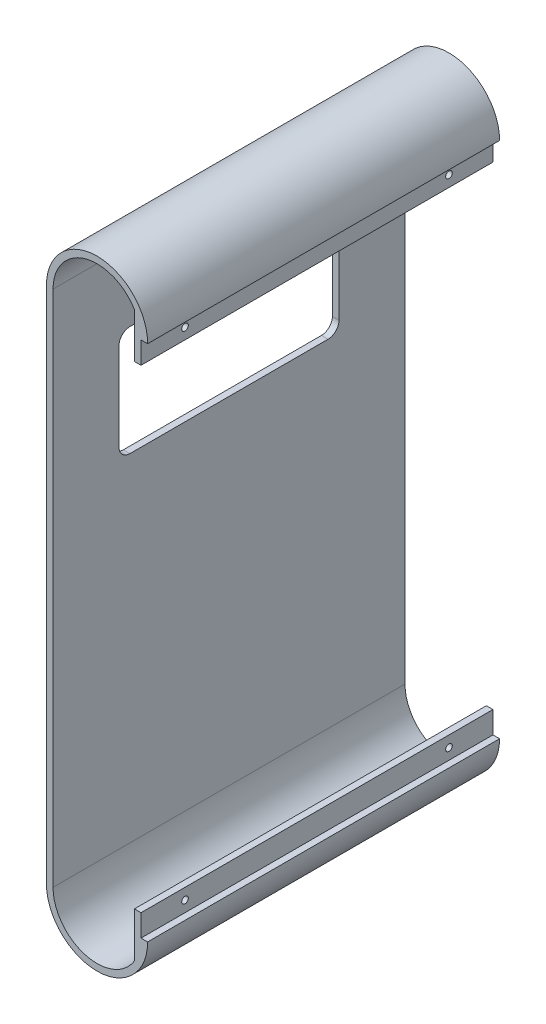
ISO-10303-21;
HEADER;
FILE_DESCRIPTION(('STEP AP214'),'2;1');
FILE_NAME('part.step','',(''),(''),'','','');
FILE_SCHEMA(('AUTOMOTIVE_DESIGN { 1 0 10303 214 1 1 1 1 }'));
ENDSEC;
DATA;
#1=APPLICATION_CONTEXT('core data for automotive mechanical design processes');
#2=APPLICATION_PROTOCOL_DEFINITION('international standard','automotive_design',2000,#1);
#3=PRODUCT_CONTEXT('',#1,'mechanical');
#4=PRODUCT('Part','Part','',(#3));
#5=PRODUCT_RELATED_PRODUCT_CATEGORY('part','',(#4));
#6=PRODUCT_DEFINITION_FORMATION('','',#4);
#7=PRODUCT_DEFINITION_CONTEXT('part definition',#1,'design');
#8=PRODUCT_DEFINITION('design','',#6,#7);
#9=PRODUCT_DEFINITION_SHAPE('','',#8);
#10=(LENGTH_UNIT() NAMED_UNIT(*) SI_UNIT(.MILLI.,.METRE.));
#11=(NAMED_UNIT(*) PLANE_ANGLE_UNIT() SI_UNIT($,.RADIAN.));
#12=(NAMED_UNIT(*) SI_UNIT($,.STERADIAN.) SOLID_ANGLE_UNIT());
#13=UNCERTAINTY_MEASURE_WITH_UNIT(LENGTH_MEASURE(1.E-05),#10,'distance_accuracy_value','');
#14=(GEOMETRIC_REPRESENTATION_CONTEXT(3) GLOBAL_UNCERTAINTY_ASSIGNED_CONTEXT((#13)) GLOBAL_UNIT_ASSIGNED_CONTEXT((#10,
#11,#12)) REPRESENTATION_CONTEXT('',''));
#15=CARTESIAN_POINT('',(0.,0.,0.));
#16=DIRECTION('',(0.,0.,1.));
#17=DIRECTION('',(1.,0.,0.));
#18=AXIS2_PLACEMENT_3D('',#15,#16,#17);
#19=CARTESIAN_POINT('',(4.,60.2499999999995,-160.000000000005));
#20=DIRECTION('',(0.,0.,-1.));
#21=DIRECTION('',(0.,-1.,0.));
#22=AXIS2_PLACEMENT_3D('',#19,#20,#21);
#23=PLANE('',#22);
#24=DIRECTION('',(1.,0.,0.));
#25=VECTOR('',#24,1.);
#26=CARTESIAN_POINT('',(0.,160.5,-160.000000000007));
#27=LINE('',#26,#25);
#28=CARTESIAN_POINT('',(0.,160.5,-160.000000000007));
#29=VERTEX_POINT('',#28);
#30=CARTESIAN_POINT('',(3.,160.5,-160.000000000007));
#31=VERTEX_POINT('',#30);
#32=EDGE_CURVE('E345',#29,#31,#27,.T.);
#33=ORIENTED_EDGE('',*,*,#32,.F.);
#34=DIRECTION('',(0.,-1.,0.));
#35=VECTOR('',#34,1.);
#36=CARTESIAN_POINT('',(-1.91556839834739E-12,150.500000000001,-160.000000000007));
#37=LINE('',#36,#35);
#38=CARTESIAN_POINT('',(-1.91556839834739E-12,150.500000000001,-160.000000000007));
#39=VERTEX_POINT('',#38);
#40=EDGE_CURVE('E262',#29,#39,#37,.T.);
#41=ORIENTED_EDGE('',*,*,#40,.T.);
#42=DIRECTION('',(-1.,0.,0.));
#43=VECTOR('',#42,1.);
#44=CARTESIAN_POINT('',(-3.00000000000191,150.500000000001,-160.000000000007));
#45=LINE('',#44,#43);
#46=CARTESIAN_POINT('',(-3.00000000000191,150.500000000001,-160.000000000007));
#47=VERTEX_POINT('',#46);
#48=EDGE_CURVE('E261',#39,#47,#45,.T.);
#49=ORIENTED_EDGE('',*,*,#48,.T.);
#50=DIRECTION('',(0.,1.,0.));
#51=VECTOR('',#50,1.);
#52=CARTESIAN_POINT('',(-3.00000000000191,150.500000000001,-160.000000000007));
#53=LINE('',#52,#51);
#54=CARTESIAN_POINT('',(-3.00000000000229,171.035653752857,-160.000000000007));
#55=VERTEX_POINT('',#54);
#56=EDGE_CURVE('E265',#47,#55,#53,.T.);
#57=ORIENTED_EDGE('',*,*,#56,.T.);
#58=CARTESIAN_POINT('',(-20.,160.5,-160.000000000007));
#59=DIRECTION('',(0.,0.,-1.));
#60=DIRECTION('',(0.,1.,0.));
#61=AXIS2_PLACEMENT_3D('',#58,#59,#60);
#62=CIRCLE('',#61,20.);
#63=CARTESIAN_POINT('',(-40.,160.5,-160.000000000005));
#64=VERTEX_POINT('',#63);
#65=EDGE_CURVE('E349',#64,#55,#62,.T.);
#66=ORIENTED_EDGE('',*,*,#65,.F.);
#67=DIRECTION('',(0.,1.,0.));
#68=VECTOR('',#67,1.);
#69=CARTESIAN_POINT('',(-40.,-74.9999999999967,-160.000000000004));
#70=LINE('',#69,#68);
#71=CARTESIAN_POINT('',(-40.,-75.,-160.000000000004));
#72=VERTEX_POINT('',#71);
#73=EDGE_CURVE('E307',#72,#64,#70,.T.);
#74=ORIENTED_EDGE('',*,*,#73,.F.);
#75=CARTESIAN_POINT('',(-20.,-75.,-160.000000000004));
#76=DIRECTION('',(0.,0.,-1.));
#77=DIRECTION('',(0.,1.,0.));
#78=AXIS2_PLACEMENT_3D('',#75,#76,#77);
#79=CIRCLE('',#78,20.);
#80=CARTESIAN_POINT('',(-3.,-85.5356537528528,-160.000000000004));
#81=VERTEX_POINT('',#80);
#82=EDGE_CURVE('E328',#81,#72,#79,.T.);
#83=ORIENTED_EDGE('',*,*,#82,.F.);
#84=DIRECTION('',(0.,1.,0.));
#85=VECTOR('',#84,1.);
#86=CARTESIAN_POINT('',(-3.,-65.,-160.000000000004));
#87=LINE('',#86,#85);
#88=CARTESIAN_POINT('',(-3.,-65.,-160.000000000004));
#89=VERTEX_POINT('',#88);
#90=EDGE_CURVE('E282',#81,#89,#87,.T.);
#91=ORIENTED_EDGE('',*,*,#90,.T.);
#92=DIRECTION('',(1.,0.,0.));
#93=VECTOR('',#92,1.);
#94=CARTESIAN_POINT('',(-3.,-65.,-160.000000000004));
#95=LINE('',#94,#93);
#96=CARTESIAN_POINT('',(0.,-65.,-160.000000000004));
#97=VERTEX_POINT('',#96);
#98=EDGE_CURVE('E287',#89,#97,#95,.T.);
#99=ORIENTED_EDGE('',*,*,#98,.T.);
#100=DIRECTION('',(0.,-1.,0.));
#101=VECTOR('',#100,1.);
#102=CARTESIAN_POINT('',(0.,-65.,-160.000000000004));
#103=LINE('',#102,#101);
#104=CARTESIAN_POINT('',(0.,-75.,-160.000000000004));
#105=VERTEX_POINT('',#104);
#106=EDGE_CURVE('E283',#97,#105,#103,.T.);
#107=ORIENTED_EDGE('',*,*,#106,.T.);
#108=DIRECTION('',(-1.,0.,0.));
#109=VECTOR('',#108,1.);
#110=CARTESIAN_POINT('',(0.,-75.,-160.000000000004));
#111=LINE('',#110,#109);
#112=CARTESIAN_POINT('',(3.,-75.,-160.000000000004));
#113=VERTEX_POINT('',#112);
#114=EDGE_CURVE('E332',#113,#105,#111,.T.);
#115=ORIENTED_EDGE('',*,*,#114,.F.);
#116=CARTESIAN_POINT('',(-20.,-75.,-160.000000000004));
#117=DIRECTION('',(0.,0.,-1.));
#118=DIRECTION('',(0.,1.,0.));
#119=AXIS2_PLACEMENT_3D('',#116,#117,#118);
#120=CIRCLE('',#119,23.);
#121=CARTESIAN_POINT('',(-43.,-75.,-160.000000000004));
#122=VERTEX_POINT('',#121);
#123=EDGE_CURVE('E335',#122,#113,#120,.F.);
#124=ORIENTED_EDGE('',*,*,#123,.F.);
#125=DIRECTION('',(0.,-1.,0.));
#126=VECTOR('',#125,1.);
#127=CARTESIAN_POINT('',(-43.,-74.9999999999967,-160.000000000004));
#128=LINE('',#127,#126);
#129=CARTESIAN_POINT('',(-43.,160.5,-160.000000000007));
#130=VERTEX_POINT('',#129);
#131=EDGE_CURVE('E338',#130,#122,#128,.T.);
#132=ORIENTED_EDGE('',*,*,#131,.F.);
#133=CARTESIAN_POINT('',(-20.,160.5,-160.000000000007));
#134=DIRECTION('',(0.,0.,-1.));
#135=DIRECTION('',(0.,1.,0.));
#136=AXIS2_PLACEMENT_3D('',#133,#134,#135);
#137=CIRCLE('',#136,23.);
#138=EDGE_CURVE('E342',#31,#130,#137,.F.);
#139=ORIENTED_EDGE('',*,*,#138,.F.);
#140=EDGE_LOOP('',(#33,#41,#49,#57,#66,#74,#83,#91,#99,#107,#115,#124,#132,#139));
#141=FACE_BOUND('',#140,.T.);
#142=ADVANCED_FACE('F35',(#141),#23,.T.);
#143=CARTESIAN_POINT('',(-20.,-75.,0.));
#144=DIRECTION('',(0.,0.,1.));
#145=DIRECTION('',(1.,0.,0.));
#146=AXIS2_PLACEMENT_3D('',#143,#144,#145);
#147=PLANE('',#146);
#148=CARTESIAN_POINT('',(-20.,160.5,0.));
#149=DIRECTION('',(0.,0.,-1.));
#150=DIRECTION('',(-1.,0.,0.));
#151=AXIS2_PLACEMENT_3D('',#148,#149,#150);
#152=CIRCLE('',#151,20.);
#153=CARTESIAN_POINT('',(-40.,160.5,0.));
#154=VERTEX_POINT('',#153);
#155=CARTESIAN_POINT('',(-3.00000000000229,171.035653752857,0.));
#156=VERTEX_POINT('',#155);
#157=EDGE_CURVE('E318',#154,#156,#152,.T.);
#158=ORIENTED_EDGE('',*,*,#157,.T.);
#159=DIRECTION('',(0.,1.,0.));
#160=VECTOR('',#159,1.);
#161=CARTESIAN_POINT('',(-3.00000000000191,150.500000000003,0.));
#162=LINE('',#161,#160);
#163=CARTESIAN_POINT('',(-3.00000000000191,150.500000000001,0.));
#164=VERTEX_POINT('',#163);
#165=EDGE_CURVE('E264',#164,#156,#162,.T.);
#166=ORIENTED_EDGE('',*,*,#165,.F.);
#167=DIRECTION('',(-1.,0.,0.));
#168=VECTOR('',#167,1.);
#169=CARTESIAN_POINT('',(-3.00000000000191,150.500000000003,0.));
#170=LINE('',#169,#168);
#171=CARTESIAN_POINT('',(-1.91556839834736E-12,150.500000000001,0.));
#172=VERTEX_POINT('',#171);
#173=EDGE_CURVE('E273',#172,#164,#170,.T.);
#174=ORIENTED_EDGE('',*,*,#173,.F.);
#175=DIRECTION('',(0.,-1.,0.));
#176=VECTOR('',#175,1.);
#177=CARTESIAN_POINT('',(-1.91556839834739E-12,150.500000000003,0.));
#178=LINE('',#177,#176);
#179=CARTESIAN_POINT('',(-2.09730250691962E-12,160.5,0.));
#180=VERTEX_POINT('',#179);
#181=EDGE_CURVE('E272',#180,#172,#178,.T.);
#182=ORIENTED_EDGE('',*,*,#181,.F.);
#183=DIRECTION('',(1.,0.,0.));
#184=VECTOR('',#183,1.);
#185=CARTESIAN_POINT('',(0.,160.5,0.));
#186=LINE('',#185,#184);
#187=CARTESIAN_POINT('',(3.,160.5,0.));
#188=VERTEX_POINT('',#187);
#189=EDGE_CURVE('E315',#180,#188,#186,.T.);
#190=ORIENTED_EDGE('',*,*,#189,.T.);
#191=CARTESIAN_POINT('',(-20.,160.5,0.));
#192=DIRECTION('',(0.,0.,1.));
#193=DIRECTION('',(-1.,0.,0.));
#194=AXIS2_PLACEMENT_3D('',#191,#192,#193);
#195=CIRCLE('',#194,23.);
#196=CARTESIAN_POINT('',(-43.,160.5,0.));
#197=VERTEX_POINT('',#196);
#198=EDGE_CURVE('E313',#188,#197,#195,.T.);
#199=ORIENTED_EDGE('',*,*,#198,.T.);
#200=DIRECTION('',(0.,-1.,0.));
#201=VECTOR('',#200,1.);
#202=CARTESIAN_POINT('',(-43.,-75.,0.));
#203=LINE('',#202,#201);
#204=CARTESIAN_POINT('',(-43.,-75.,0.));
#205=VERTEX_POINT('',#204);
#206=EDGE_CURVE('E310',#197,#205,#203,.T.);
#207=ORIENTED_EDGE('',*,*,#206,.T.);
#208=CARTESIAN_POINT('',(-20.,-75.,0.));
#209=DIRECTION('',(0.,0.,1.));
#210=DIRECTION('',(1.,0.,0.));
#211=AXIS2_PLACEMENT_3D('',#208,#209,#210);
#212=CIRCLE('',#211,23.);
#213=CARTESIAN_POINT('',(3.,-75.,0.));
#214=VERTEX_POINT('',#213);
#215=EDGE_CURVE('E308',#205,#214,#212,.T.);
#216=ORIENTED_EDGE('',*,*,#215,.T.);
#217=DIRECTION('',(-1.,0.,0.));
#218=VECTOR('',#217,1.);
#219=CARTESIAN_POINT('',(0.,-75.,0.));
#220=LINE('',#219,#218);
#221=CARTESIAN_POINT('',(0.,-75.,0.));
#222=VERTEX_POINT('',#221);
#223=EDGE_CURVE('E304',#214,#222,#220,.T.);
#224=ORIENTED_EDGE('',*,*,#223,.T.);
#225=DIRECTION('',(0.,-1.,0.));
#226=VECTOR('',#225,1.);
#227=CARTESIAN_POINT('',(0.,-64.9999999999979,0.));
#228=LINE('',#227,#226);
#229=CARTESIAN_POINT('',(0.,-64.9999999999982,0.));
#230=VERTEX_POINT('',#229);
#231=EDGE_CURVE('E297',#230,#222,#228,.T.);
#232=ORIENTED_EDGE('',*,*,#231,.F.);
#233=DIRECTION('',(1.,0.,0.));
#234=VECTOR('',#233,1.);
#235=CARTESIAN_POINT('',(-3.,-64.9999999999982,0.));
#236=LINE('',#235,#234);
#237=CARTESIAN_POINT('',(-3.,-64.9999999999982,0.));
#238=VERTEX_POINT('',#237);
#239=EDGE_CURVE('E286',#238,#230,#236,.T.);
#240=ORIENTED_EDGE('',*,*,#239,.F.);
#241=DIRECTION('',(0.,1.,0.));
#242=VECTOR('',#241,1.);
#243=CARTESIAN_POINT('',(-3.,-64.9999999999979,0.));
#244=LINE('',#243,#242);
#245=CARTESIAN_POINT('',(-3.,-85.5356537528528,0.));
#246=VERTEX_POINT('',#245);
#247=EDGE_CURVE('E294',#246,#238,#244,.T.);
#248=ORIENTED_EDGE('',*,*,#247,.F.);
#249=CARTESIAN_POINT('',(-20.,-75.,0.));
#250=DIRECTION('',(0.,0.,-1.));
#251=DIRECTION('',(1.,0.,0.));
#252=AXIS2_PLACEMENT_3D('',#249,#250,#251);
#253=CIRCLE('',#252,20.);
#254=CARTESIAN_POINT('',(-40.,-75.,0.));
#255=VERTEX_POINT('',#254);
#256=EDGE_CURVE('E303',#246,#255,#253,.T.);
#257=ORIENTED_EDGE('',*,*,#256,.T.);
#258=DIRECTION('',(0.,1.,0.));
#259=VECTOR('',#258,1.);
#260=CARTESIAN_POINT('',(-40.,-75.,0.));
#261=LINE('',#260,#259);
#262=EDGE_CURVE('E321',#255,#154,#261,.T.);
#263=ORIENTED_EDGE('',*,*,#262,.T.);
#264=EDGE_LOOP('',(#158,#166,#174,#182,#190,#199,#207,#216,#224,#232,#240,#248,#257,#263));
#265=FACE_BOUND('',#264,.T.);
#266=ADVANCED_FACE('F392',(#265),#147,.T.);
#267=CARTESIAN_POINT('',(-40.,-75.,-445.233676132401));
#268=DIRECTION('',(1.,0.,0.));
#269=DIRECTION('',(0.,0.,-1.));
#270=AXIS2_PLACEMENT_3D('',#267,#268,#269);
#271=PLANE('',#270);
#272=DIRECTION('',(0.,-1.,0.));
#273=VECTOR('',#272,1.);
#274=CARTESIAN_POINT('',(-40.,123.257283518407,-130.00000000001));
#275=LINE('',#274,#273);
#276=CARTESIAN_POINT('',(-40.,123.257283518407,-130.00000000001));
#277=VERTEX_POINT('',#276);
#278=CARTESIAN_POINT('',(-40.,83.2572835184067,-130.00000000001));
#279=VERTEX_POINT('',#278);
#280=EDGE_CURVE('E199',#277,#279,#275,.T.);
#281=ORIENTED_EDGE('',*,*,#280,.T.);
#282=CARTESIAN_POINT('',(-40.,83.2572835184067,-125.00000000001));
#283=DIRECTION('',(1.,0.,0.));
#284=DIRECTION('',(0.,0.,-1.));
#285=AXIS2_PLACEMENT_3D('',#282,#283,#284);
#286=CIRCLE('',#285,5.);
#287=CARTESIAN_POINT('',(-40.,78.2572835184067,-125.00000000001));
#288=VERTEX_POINT('',#287);
#289=EDGE_CURVE('E186',#279,#288,#286,.F.);
#290=ORIENTED_EDGE('',*,*,#289,.T.);
#291=DIRECTION('',(0.,0.,1.));
#292=VECTOR('',#291,1.);
#293=CARTESIAN_POINT('',(-40.,78.2572835184067,-125.00000000001));
#294=LINE('',#293,#292);
#295=CARTESIAN_POINT('',(-40.,78.2572835184067,-35.0000000000102));
#296=VERTEX_POINT('',#295);
#297=EDGE_CURVE('E233',#288,#296,#294,.T.);
#298=ORIENTED_EDGE('',*,*,#297,.T.);
#299=CARTESIAN_POINT('',(-40.,83.2572835184067,-35.0000000000102));
#300=DIRECTION('',(1.,0.,0.));
#301=DIRECTION('',(0.,0.,-1.));
#302=AXIS2_PLACEMENT_3D('',#299,#300,#301);
#303=CIRCLE('',#302,5.);
#304=CARTESIAN_POINT('',(-40.,83.2572835184067,-30.0000000000102));
#305=VERTEX_POINT('',#304);
#306=EDGE_CURVE('E229',#296,#305,#303,.F.);
#307=ORIENTED_EDGE('',*,*,#306,.T.);
#308=DIRECTION('',(0.,1.,0.));
#309=VECTOR('',#308,1.);
#310=CARTESIAN_POINT('',(-40.,123.257283518407,-30.0000000000102));
#311=LINE('',#310,#309);
#312=CARTESIAN_POINT('',(-40.,123.257283518407,-30.0000000000102));
#313=VERTEX_POINT('',#312);
#314=EDGE_CURVE('E225',#305,#313,#311,.T.);
#315=ORIENTED_EDGE('',*,*,#314,.T.);
#316=CARTESIAN_POINT('',(-40.,123.257283518407,-35.0000000000102));
#317=DIRECTION('',(1.,0.,0.));
#318=DIRECTION('',(0.,0.,-1.));
#319=AXIS2_PLACEMENT_3D('',#316,#317,#318);
#320=CIRCLE('',#319,5.);
#321=CARTESIAN_POINT('',(-40.,128.257283518407,-35.0000000000102));
#322=VERTEX_POINT('',#321);
#323=EDGE_CURVE('E221',#313,#322,#320,.F.);
#324=ORIENTED_EDGE('',*,*,#323,.T.);
#325=DIRECTION('',(0.,0.,-1.));
#326=VECTOR('',#325,1.);
#327=CARTESIAN_POINT('',(-40.,128.257283518407,-125.00000000001));
#328=LINE('',#327,#326);
#329=CARTESIAN_POINT('',(-40.,128.257283518407,-125.00000000001));
#330=VERTEX_POINT('',#329);
#331=EDGE_CURVE('E218',#322,#330,#328,.T.);
#332=ORIENTED_EDGE('',*,*,#331,.T.);
#333=CARTESIAN_POINT('',(-40.,123.257283518407,-125.00000000001));
#334=DIRECTION('',(1.,0.,0.));
#335=DIRECTION('',(0.,0.,-1.));
#336=AXIS2_PLACEMENT_3D('',#333,#334,#335);
#337=CIRCLE('',#336,5.);
#338=EDGE_CURVE('E208',#330,#277,#337,.F.);
#339=ORIENTED_EDGE('',*,*,#338,.T.);
#340=EDGE_LOOP('',(#281,#290,#298,#307,#315,#324,#332,#339));
#341=FACE_BOUND('',#340,.T.);
#342=DIRECTION('',(0.,0.,1.));
#343=VECTOR('',#342,1.);
#344=CARTESIAN_POINT('',(-40.,-75.,-445.233676132401));
#345=LINE('',#344,#343);
#346=EDGE_CURVE('E330',#72,#255,#345,.T.);
#347=ORIENTED_EDGE('',*,*,#346,.F.);
#348=ORIENTED_EDGE('',*,*,#73,.T.);
#349=DIRECTION('',(0.,0.,1.));
#350=VECTOR('',#349,1.);
#351=CARTESIAN_POINT('',(-40.,160.5,-445.233676132401));
#352=LINE('',#351,#350);
#353=EDGE_CURVE('E327',#64,#154,#352,.T.);
#354=ORIENTED_EDGE('',*,*,#353,.T.);
#355=ORIENTED_EDGE('',*,*,#262,.F.);
#356=EDGE_LOOP('',(#347,#348,#354,#355));
#357=FACE_BOUND('',#356,.T.);
#358=ADVANCED_FACE('F205',(#341,#357),#271,.T.);
#359=CARTESIAN_POINT('',(-20.,160.5,-445.233676132401));
#360=DIRECTION('',(0.,0.,1.));
#361=DIRECTION('',(1.,0.,0.));
#362=AXIS2_PLACEMENT_3D('',#359,#360,#361);
#363=CYLINDRICAL_SURFACE('',#362,20.);
#364=DIRECTION('',(0.,0.,1.));
#365=VECTOR('',#364,1.);
#366=CARTESIAN_POINT('',(-3.00000000000229,171.035653752857,-445.233676132401));
#367=LINE('',#366,#365);
#368=EDGE_CURVE('E11',#156,#55,#367,.F.);
#369=ORIENTED_EDGE('',*,*,#368,.F.);
#370=ORIENTED_EDGE('',*,*,#157,.F.);
#371=ORIENTED_EDGE('',*,*,#353,.F.);
#372=ORIENTED_EDGE('',*,*,#65,.T.);
#373=EDGE_LOOP('',(#369,#370,#371,#372));
#374=FACE_BOUND('',#373,.T.);
#375=ADVANCED_FACE('F404',(#374),#363,.F.);
#376=CARTESIAN_POINT('',(0.,160.5,-445.233676132401));
#377=DIRECTION('',(0.,-1.,0.));
#378=DIRECTION('',(0.,0.,-1.));
#379=AXIS2_PLACEMENT_3D('',#376,#377,#378);
#380=PLANE('',#379);
#381=DIRECTION('',(0.,0.,1.));
#382=VECTOR('',#381,1.);
#383=CARTESIAN_POINT('',(0.,160.5,-445.233676132401));
#384=LINE('',#383,#382);
#385=EDGE_CURVE('E348',#29,#180,#384,.T.);
#386=ORIENTED_EDGE('',*,*,#385,.F.);
#387=ORIENTED_EDGE('',*,*,#32,.T.);
#388=DIRECTION('',(0.,0.,1.));
#389=VECTOR('',#388,1.);
#390=CARTESIAN_POINT('',(3.,160.5,-445.233676132401));
#391=LINE('',#390,#389);
#392=EDGE_CURVE('E344',#31,#188,#391,.T.);
#393=ORIENTED_EDGE('',*,*,#392,.T.);
#394=ORIENTED_EDGE('',*,*,#189,.F.);
#395=EDGE_LOOP('',(#386,#387,#393,#394));
#396=FACE_BOUND('',#395,.T.);
#397=ADVANCED_FACE('F389',(#396),#380,.T.);
#398=CARTESIAN_POINT('',(-20.,160.5,-445.233676132401));
#399=DIRECTION('',(0.,0.,1.));
#400=DIRECTION('',(1.,0.,0.));
#401=AXIS2_PLACEMENT_3D('',#398,#399,#400);
#402=CYLINDRICAL_SURFACE('',#401,23.);
#403=ORIENTED_EDGE('',*,*,#138,.T.);
#404=DIRECTION('',(0.,0.,1.));
#405=VECTOR('',#404,1.);
#406=CARTESIAN_POINT('',(-43.,160.5,-445.233676132401));
#407=LINE('',#406,#405);
#408=EDGE_CURVE('E341',#130,#197,#407,.T.);
#409=ORIENTED_EDGE('',*,*,#408,.T.);
#410=ORIENTED_EDGE('',*,*,#198,.F.);
#411=ORIENTED_EDGE('',*,*,#392,.F.);
#412=EDGE_LOOP('',(#403,#409,#410,#411));
#413=FACE_BOUND('',#412,.T.);
#414=ADVANCED_FACE('F436',(#413),#402,.T.);
#415=CARTESIAN_POINT('',(-43.,-75.,-445.233676132401));
#416=DIRECTION('',(-1.,0.,0.));
#417=DIRECTION('',(0.,-1.,0.));
#418=AXIS2_PLACEMENT_3D('',#415,#416,#417);
#419=PLANE('',#418);
#420=DIRECTION('',(0.,-1.,0.));
#421=VECTOR('',#420,1.);
#422=CARTESIAN_POINT('',(-43.,123.257283518407,-130.00000000001));
#423=LINE('',#422,#421);
#424=CARTESIAN_POINT('',(-43.,123.257283518407,-130.00000000001));
#425=VERTEX_POINT('',#424);
#426=CARTESIAN_POINT('',(-43.,83.2572835184067,-130.00000000001));
#427=VERTEX_POINT('',#426);
#428=EDGE_CURVE('E202',#425,#427,#423,.T.);
#429=ORIENTED_EDGE('',*,*,#428,.F.);
#430=CARTESIAN_POINT('',(-43.,123.257283518407,-125.00000000001));
#431=DIRECTION('',(-1.,0.,0.));
#432=DIRECTION('',(0.,-1.,0.));
#433=AXIS2_PLACEMENT_3D('',#430,#431,#432);
#434=CIRCLE('',#433,5.);
#435=CARTESIAN_POINT('',(-43.,128.257283518407,-125.00000000001));
#436=VERTEX_POINT('',#435);
#437=EDGE_CURVE('E214',#436,#425,#434,.T.);
#438=ORIENTED_EDGE('',*,*,#437,.F.);
#439=DIRECTION('',(0.,0.,-1.));
#440=VECTOR('',#439,1.);
#441=CARTESIAN_POINT('',(-43.,128.257283518407,-125.00000000001));
#442=LINE('',#441,#440);
#443=CARTESIAN_POINT('',(-43.,128.257283518407,-35.0000000000102));
#444=VERTEX_POINT('',#443);
#445=EDGE_CURVE('E59',#444,#436,#442,.T.);
#446=ORIENTED_EDGE('',*,*,#445,.F.);
#447=CARTESIAN_POINT('',(-43.,123.257283518407,-35.0000000000102));
#448=DIRECTION('',(-1.,0.,0.));
#449=DIRECTION('',(0.,1.,0.));
#450=AXIS2_PLACEMENT_3D('',#447,#448,#449);
#451=CIRCLE('',#450,5.);
#452=CARTESIAN_POINT('',(-43.,123.257283518407,-30.0000000000102));
#453=VERTEX_POINT('',#452);
#454=EDGE_CURVE('E210',#453,#444,#451,.T.);
#455=ORIENTED_EDGE('',*,*,#454,.F.);
#456=DIRECTION('',(0.,1.,0.));
#457=VECTOR('',#456,1.);
#458=CARTESIAN_POINT('',(-43.,123.257283518407,-30.0000000000102));
#459=LINE('',#458,#457);
#460=CARTESIAN_POINT('',(-43.,83.2572835184067,-30.0000000000102));
#461=VERTEX_POINT('',#460);
#462=EDGE_CURVE('E699',#461,#453,#459,.T.);
#463=ORIENTED_EDGE('',*,*,#462,.F.);
#464=CARTESIAN_POINT('',(-43.,83.2572835184067,-35.0000000000102));
#465=DIRECTION('',(-1.,0.,0.));
#466=DIRECTION('',(0.,-1.,0.));
#467=AXIS2_PLACEMENT_3D('',#464,#465,#466);
#468=CIRCLE('',#467,5.);
#469=CARTESIAN_POINT('',(-43.,78.2572835184067,-35.0000000000102));
#470=VERTEX_POINT('',#469);
#471=EDGE_CURVE('E696',#470,#461,#468,.T.);
#472=ORIENTED_EDGE('',*,*,#471,.F.);
#473=DIRECTION('',(0.,0.,1.));
#474=VECTOR('',#473,1.);
#475=CARTESIAN_POINT('',(-43.,78.2572835184067,-125.00000000001));
#476=LINE('',#475,#474);
#477=CARTESIAN_POINT('',(-43.,78.2572835184067,-125.00000000001));
#478=VERTEX_POINT('',#477);
#479=EDGE_CURVE('E691',#478,#470,#476,.T.);
#480=ORIENTED_EDGE('',*,*,#479,.F.);
#481=CARTESIAN_POINT('',(-43.,83.2572835184067,-125.00000000001));
#482=DIRECTION('',(-1.,0.,0.));
#483=DIRECTION('',(0.,-1.,0.));
#484=AXIS2_PLACEMENT_3D('',#481,#482,#483);
#485=CIRCLE('',#484,5.);
#486=EDGE_CURVE('E690',#427,#478,#485,.T.);
#487=ORIENTED_EDGE('',*,*,#486,.F.);
#488=EDGE_LOOP('',(#429,#438,#446,#455,#463,#472,#480,#487));
#489=FACE_BOUND('',#488,.T.);
#490=ORIENTED_EDGE('',*,*,#408,.F.);
#491=ORIENTED_EDGE('',*,*,#131,.T.);
#492=DIRECTION('',(0.,0.,1.));
#493=VECTOR('',#492,1.);
#494=CARTESIAN_POINT('',(-43.,-75.,-445.233676132401));
#495=LINE('',#494,#493);
#496=EDGE_CURVE('E337',#122,#205,#495,.T.);
#497=ORIENTED_EDGE('',*,*,#496,.T.);
#498=ORIENTED_EDGE('',*,*,#206,.F.);
#499=EDGE_LOOP('',(#490,#491,#497,#498));
#500=FACE_BOUND('',#499,.T.);
#501=ADVANCED_FACE('F434',(#489,#500),#419,.T.);
#502=CARTESIAN_POINT('',(-20.,-75.,-445.233676132401));
#503=DIRECTION('',(0.,0.,1.));
#504=DIRECTION('',(1.,0.,0.));
#505=AXIS2_PLACEMENT_3D('',#502,#503,#504);
#506=CYLINDRICAL_SURFACE('',#505,23.);
#507=ORIENTED_EDGE('',*,*,#123,.T.);
#508=DIRECTION('',(0.,0.,1.));
#509=VECTOR('',#508,1.);
#510=CARTESIAN_POINT('',(3.,-75.,-445.233676132401));
#511=LINE('',#510,#509);
#512=EDGE_CURVE('E334',#113,#214,#511,.T.);
#513=ORIENTED_EDGE('',*,*,#512,.T.);
#514=ORIENTED_EDGE('',*,*,#215,.F.);
#515=ORIENTED_EDGE('',*,*,#496,.F.);
#516=EDGE_LOOP('',(#507,#513,#514,#515));
#517=FACE_BOUND('',#516,.T.);
#518=ADVANCED_FACE('F431',(#517),#506,.T.);
#519=CARTESIAN_POINT('',(0.,-75.,-445.233676132401));
#520=DIRECTION('',(0.,1.,0.));
#521=DIRECTION('',(0.,0.,1.));
#522=AXIS2_PLACEMENT_3D('',#519,#520,#521);
#523=PLANE('',#522);
#524=ORIENTED_EDGE('',*,*,#512,.F.);
#525=ORIENTED_EDGE('',*,*,#114,.T.);
#526=DIRECTION('',(0.,0.,1.));
#527=VECTOR('',#526,1.);
#528=CARTESIAN_POINT('',(0.,-75.,-445.233676132401));
#529=LINE('',#528,#527);
#530=EDGE_CURVE('E331',#105,#222,#529,.T.);
#531=ORIENTED_EDGE('',*,*,#530,.T.);
#532=ORIENTED_EDGE('',*,*,#223,.F.);
#533=EDGE_LOOP('',(#524,#525,#531,#532));
#534=FACE_BOUND('',#533,.T.);
#535=ADVANCED_FACE('F426',(#534),#523,.T.);
#536=CARTESIAN_POINT('',(-20.,-75.,-445.233676132401));
#537=DIRECTION('',(0.,0.,1.));
#538=DIRECTION('',(1.,0.,0.));
#539=AXIS2_PLACEMENT_3D('',#536,#537,#538);
#540=CYLINDRICAL_SURFACE('',#539,20.);
#541=DIRECTION('',(0.,0.,1.));
#542=VECTOR('',#541,1.);
#543=CARTESIAN_POINT('',(-3.,-85.5356537528528,-445.233676132401));
#544=LINE('',#543,#542);
#545=EDGE_CURVE('E43',#81,#246,#544,.T.);
#546=ORIENTED_EDGE('',*,*,#545,.F.);
#547=ORIENTED_EDGE('',*,*,#82,.T.);
#548=ORIENTED_EDGE('',*,*,#346,.T.);
#549=ORIENTED_EDGE('',*,*,#256,.F.);
#550=EDGE_LOOP('',(#546,#547,#548,#549));
#551=FACE_BOUND('',#550,.T.);
#552=ADVANCED_FACE('F407',(#551),#540,.F.);
#553=CARTESIAN_POINT('',(0.,-64.9999999999979,21.5674832521582));
#554=DIRECTION('',(1.,0.,0.));
#555=DIRECTION('',(0.,1.,0.));
#556=AXIS2_PLACEMENT_3D('',#553,#554,#555);
#557=PLANE('',#556);
#558=CARTESIAN_POINT('',(0.,-69.9999999999982,-20.));
#559=DIRECTION('',(1.,0.,0.));
#560=DIRECTION('',(0.,1.,0.));
#561=AXIS2_PLACEMENT_3D('',#558,#559,#560);
#562=CIRCLE('',#561,1.5);
#563=CARTESIAN_POINT('',(0.,-68.4999999999982,-20.));
#564=VERTEX_POINT('',#563);
#565=EDGE_CURVE('E258',#564,#564,#562,.T.);
#566=ORIENTED_EDGE('',*,*,#565,.F.);
#567=EDGE_LOOP('',(#566));
#568=FACE_BOUND('',#567,.T.);
#569=CARTESIAN_POINT('',(0.,-69.9999999999982,-140.000000000007));
#570=DIRECTION('',(1.,0.,0.));
#571=DIRECTION('',(0.,1.,0.));
#572=AXIS2_PLACEMENT_3D('',#569,#570,#571);
#573=CIRCLE('',#572,1.5);
#574=CARTESIAN_POINT('',(0.,-68.4999999999982,-140.000000000007));
#575=VERTEX_POINT('',#574);
#576=EDGE_CURVE('E255',#575,#575,#573,.T.);
#577=ORIENTED_EDGE('',*,*,#576,.F.);
#578=EDGE_LOOP('',(#577));
#579=FACE_BOUND('',#578,.T.);
#580=ORIENTED_EDGE('',*,*,#530,.F.);
#581=ORIENTED_EDGE('',*,*,#106,.F.);
#582=DIRECTION('',(0.,0.,-1.));
#583=VECTOR('',#582,1.);
#584=CARTESIAN_POINT('',(0.,-64.9999999999979,21.5674832521582));
#585=LINE('',#584,#583);
#586=EDGE_CURVE('E293',#230,#97,#585,.T.);
#587=ORIENTED_EDGE('',*,*,#586,.F.);
#588=ORIENTED_EDGE('',*,*,#231,.T.);
#589=EDGE_LOOP('',(#580,#581,#587,#588));
#590=FACE_BOUND('',#589,.T.);
#591=ADVANCED_FACE('F423',(#568,#579,#590),#557,.T.);
#592=CARTESIAN_POINT('',(-3.,-64.9999999999979,21.5674832521582));
#593=DIRECTION('',(0.,1.,0.));
#594=DIRECTION('',(0.,0.,1.));
#595=AXIS2_PLACEMENT_3D('',#592,#593,#594);
#596=PLANE('',#595);
#597=DIRECTION('',(0.,0.,-1.));
#598=VECTOR('',#597,1.);
#599=CARTESIAN_POINT('',(-3.,-64.9999999999979,21.5674832521582));
#600=LINE('',#599,#598);
#601=EDGE_CURVE('E296',#238,#89,#600,.T.);
#602=ORIENTED_EDGE('',*,*,#601,.F.);
#603=ORIENTED_EDGE('',*,*,#239,.T.);
#604=ORIENTED_EDGE('',*,*,#586,.T.);
#605=ORIENTED_EDGE('',*,*,#98,.F.);
#606=EDGE_LOOP('',(#602,#603,#604,#605));
#607=FACE_BOUND('',#606,.T.);
#608=ADVANCED_FACE('F416',(#607),#596,.T.);
#609=CARTESIAN_POINT('',(-3.,-64.9999999999979,21.5674832521582));
#610=DIRECTION('',(-1.,0.,0.));
#611=DIRECTION('',(0.,-1.,0.));
#612=AXIS2_PLACEMENT_3D('',#609,#610,#611);
#613=PLANE('',#612);
#614=CARTESIAN_POINT('',(-3.,-69.9999999999982,-20.));
#615=DIRECTION('',(-1.,0.,0.));
#616=DIRECTION('',(0.,-1.,0.));
#617=AXIS2_PLACEMENT_3D('',#614,#615,#616);
#618=CIRCLE('',#617,1.5);
#619=CARTESIAN_POINT('',(-3.,-71.4999999999982,-20.));
#620=VERTEX_POINT('',#619);
#621=EDGE_CURVE('E243',#620,#620,#618,.T.);
#622=ORIENTED_EDGE('',*,*,#621,.F.);
#623=EDGE_LOOP('',(#622));
#624=FACE_BOUND('',#623,.T.);
#625=CARTESIAN_POINT('',(-3.,-69.9999999999982,-140.000000000007));
#626=DIRECTION('',(-1.,0.,0.));
#627=DIRECTION('',(0.,-1.,0.));
#628=AXIS2_PLACEMENT_3D('',#625,#626,#627);
#629=CIRCLE('',#628,1.5);
#630=CARTESIAN_POINT('',(-3.,-71.4999999999982,-140.000000000007));
#631=VERTEX_POINT('',#630);
#632=EDGE_CURVE('E246',#631,#631,#629,.T.);
#633=ORIENTED_EDGE('',*,*,#632,.F.);
#634=EDGE_LOOP('',(#633));
#635=FACE_BOUND('',#634,.T.);
#636=ORIENTED_EDGE('',*,*,#90,.F.);
#637=ORIENTED_EDGE('',*,*,#545,.T.);
#638=ORIENTED_EDGE('',*,*,#247,.T.);
#639=ORIENTED_EDGE('',*,*,#601,.T.);
#640=EDGE_LOOP('',(#636,#637,#638,#639));
#641=FACE_BOUND('',#640,.T.);
#642=ADVANCED_FACE('F410',(#624,#635,#641),#613,.T.);
#643=CARTESIAN_POINT('',(-3.00000000000191,150.500000000003,21.5674832521557));
#644=DIRECTION('',(-1.,0.,0.));
#645=DIRECTION('',(0.,-1.,0.));
#646=AXIS2_PLACEMENT_3D('',#643,#644,#645);
#647=PLANE('',#646);
#648=CARTESIAN_POINT('',(-2.99999999999997,155.499999999999,-140.000000000007));
#649=DIRECTION('',(-1.,0.,0.));
#650=DIRECTION('',(0.,1.,0.));
#651=AXIS2_PLACEMENT_3D('',#648,#649,#650);
#652=CIRCLE('',#651,1.5);
#653=CARTESIAN_POINT('',(-2.99999999999997,156.999999999999,-140.000000000007));
#654=VERTEX_POINT('',#653);
#655=EDGE_CURVE('E242',#654,#654,#652,.T.);
#656=ORIENTED_EDGE('',*,*,#655,.F.);
#657=EDGE_LOOP('',(#656));
#658=FACE_BOUND('',#657,.T.);
#659=CARTESIAN_POINT('',(-2.99999999999997,155.499999999999,-20.));
#660=DIRECTION('',(-1.,0.,0.));
#661=DIRECTION('',(0.,1.,0.));
#662=AXIS2_PLACEMENT_3D('',#659,#660,#661);
#663=CIRCLE('',#662,1.5);
#664=CARTESIAN_POINT('',(-2.99999999999997,156.999999999999,-20.));
#665=VERTEX_POINT('',#664);
#666=EDGE_CURVE('E247',#665,#665,#663,.T.);
#667=ORIENTED_EDGE('',*,*,#666,.F.);
#668=EDGE_LOOP('',(#667));
#669=FACE_BOUND('',#668,.T.);
#670=ORIENTED_EDGE('',*,*,#165,.T.);
#671=ORIENTED_EDGE('',*,*,#368,.T.);
#672=ORIENTED_EDGE('',*,*,#56,.F.);
#673=DIRECTION('',(0.,0.,-1.));
#674=VECTOR('',#673,1.);
#675=CARTESIAN_POINT('',(-3.00000000000191,150.500000000003,21.5674832521557));
#676=LINE('',#675,#674);
#677=EDGE_CURVE('E276',#164,#47,#676,.T.);
#678=ORIENTED_EDGE('',*,*,#677,.F.);
#679=EDGE_LOOP('',(#670,#671,#672,#678));
#680=FACE_BOUND('',#679,.T.);
#681=ADVANCED_FACE('F377',(#658,#669,#680),#647,.T.);
#682=CARTESIAN_POINT('',(-1.91556839834739E-12,150.500000000003,21.5674832521557));
#683=DIRECTION('',(1.,0.,0.));
#684=DIRECTION('',(0.,1.,0.));
#685=AXIS2_PLACEMENT_3D('',#682,#683,#684);
#686=PLANE('',#685);
#687=CARTESIAN_POINT('',(-2.00664138083617E-12,155.499999999999,-140.000000000007));
#688=DIRECTION('',(1.,0.,0.));
#689=DIRECTION('',(0.,1.,0.));
#690=AXIS2_PLACEMENT_3D('',#687,#688,#689);
#691=CIRCLE('',#690,1.5);
#692=CARTESIAN_POINT('',(-2.03390149712201E-12,156.999999999999,-140.000000000007));
#693=VERTEX_POINT('',#692);
#694=EDGE_CURVE('E38',#693,#693,#691,.T.);
#695=ORIENTED_EDGE('',*,*,#694,.F.);
#696=EDGE_LOOP('',(#695));
#697=FACE_BOUND('',#696,.T.);
#698=CARTESIAN_POINT('',(-2.00664138083617E-12,155.499999999999,-20.));
#699=DIRECTION('',(1.,0.,0.));
#700=DIRECTION('',(0.,1.,0.));
#701=AXIS2_PLACEMENT_3D('',#698,#699,#700);
#702=CIRCLE('',#701,1.5);
#703=CARTESIAN_POINT('',(-2.03390149712201E-12,156.999999999999,-20.));
#704=VERTEX_POINT('',#703);
#705=EDGE_CURVE('E254',#704,#704,#702,.T.);
#706=ORIENTED_EDGE('',*,*,#705,.F.);
#707=EDGE_LOOP('',(#706));
#708=FACE_BOUND('',#707,.T.);
#709=ORIENTED_EDGE('',*,*,#40,.F.);
#710=ORIENTED_EDGE('',*,*,#385,.T.);
#711=ORIENTED_EDGE('',*,*,#181,.T.);
#712=DIRECTION('',(0.,0.,-1.));
#713=VECTOR('',#712,1.);
#714=CARTESIAN_POINT('',(-1.91556839834739E-12,150.500000000003,21.5674832521557));
#715=LINE('',#714,#713);
#716=EDGE_CURVE('E277',#172,#39,#715,.T.);
#717=ORIENTED_EDGE('',*,*,#716,.T.);
#718=EDGE_LOOP('',(#709,#710,#711,#717));
#719=FACE_BOUND('',#718,.T.);
#720=ADVANCED_FACE('F373',(#697,#708,#719),#686,.T.);
#721=CARTESIAN_POINT('',(-3.00000000000191,150.500000000003,21.5674832521557));
#722=DIRECTION('',(0.,-1.,0.));
#723=DIRECTION('',(1.,0.,0.));
#724=AXIS2_PLACEMENT_3D('',#721,#722,#723);
#725=PLANE('',#724);
#726=ORIENTED_EDGE('',*,*,#716,.F.);
#727=ORIENTED_EDGE('',*,*,#173,.T.);
#728=ORIENTED_EDGE('',*,*,#677,.T.);
#729=ORIENTED_EDGE('',*,*,#48,.F.);
#730=EDGE_LOOP('',(#726,#727,#728,#729));
#731=FACE_BOUND('',#730,.T.);
#732=ADVANCED_FACE('F376',(#731),#725,.T.);
#733=CARTESIAN_POINT('',(3.00000000000003,155.499999999999,-20.));
#734=DIRECTION('',(-1.,0.,0.));
#735=DIRECTION('',(0.,-1.,0.));
#736=AXIS2_PLACEMENT_3D('',#733,#734,#735);
#737=CYLINDRICAL_SURFACE('',#736,1.5);
#738=ORIENTED_EDGE('',*,*,#705,.T.);
#739=EDGE_LOOP('',(#738));
#740=FACE_BOUND('',#739,.T.);
#741=ORIENTED_EDGE('',*,*,#666,.T.);
#742=EDGE_LOOP('',(#741));
#743=FACE_BOUND('',#742,.T.);
#744=ADVANCED_FACE('F510',(#740,#743),#737,.F.);
#745=CARTESIAN_POINT('',(3.00000000000003,155.499999999999,-140.000000000007));
#746=DIRECTION('',(-1.,0.,0.));
#747=DIRECTION('',(0.,-1.,0.));
#748=AXIS2_PLACEMENT_3D('',#745,#746,#747);
#749=CYLINDRICAL_SURFACE('',#748,1.5);
#750=ORIENTED_EDGE('',*,*,#694,.T.);
#751=EDGE_LOOP('',(#750));
#752=FACE_BOUND('',#751,.T.);
#753=ORIENTED_EDGE('',*,*,#655,.T.);
#754=EDGE_LOOP('',(#753));
#755=FACE_BOUND('',#754,.T.);
#756=ADVANCED_FACE('F370',(#752,#755),#749,.F.);
#757=CARTESIAN_POINT('',(3.,-69.9999999999982,-140.000000000007));
#758=DIRECTION('',(-1.,0.,0.));
#759=DIRECTION('',(0.,-1.,0.));
#760=AXIS2_PLACEMENT_3D('',#757,#758,#759);
#761=CYLINDRICAL_SURFACE('',#760,1.5);
#762=ORIENTED_EDGE('',*,*,#576,.T.);
#763=EDGE_LOOP('',(#762));
#764=FACE_BOUND('',#763,.T.);
#765=ORIENTED_EDGE('',*,*,#632,.T.);
#766=EDGE_LOOP('',(#765));
#767=FACE_BOUND('',#766,.T.);
#768=ADVANCED_FACE('F522',(#764,#767),#761,.F.);
#769=CARTESIAN_POINT('',(3.,-69.9999999999982,-20.));
#770=DIRECTION('',(-1.,0.,0.));
#771=DIRECTION('',(0.,-1.,0.));
#772=AXIS2_PLACEMENT_3D('',#769,#770,#771);
#773=CYLINDRICAL_SURFACE('',#772,1.5);
#774=ORIENTED_EDGE('',*,*,#565,.T.);
#775=EDGE_LOOP('',(#774));
#776=FACE_BOUND('',#775,.T.);
#777=ORIENTED_EDGE('',*,*,#621,.T.);
#778=EDGE_LOOP('',(#777));
#779=FACE_BOUND('',#778,.T.);
#780=ADVANCED_FACE('F529',(#776,#779),#773,.F.);
#781=CARTESIAN_POINT('',(71.8033988749896,123.257283518407,-130.00000000001));
#782=DIRECTION('',(0.,0.,-1.));
#783=DIRECTION('',(-1.,0.,0.));
#784=AXIS2_PLACEMENT_3D('',#781,#782,#783);
#785=PLANE('',#784);
#786=DIRECTION('',(-1.,0.,0.));
#787=VECTOR('',#786,1.);
#788=CARTESIAN_POINT('',(71.8033988749896,123.257283518407,-130.00000000001));
#789=LINE('',#788,#787);
#790=EDGE_CURVE('E51',#277,#425,#789,.T.);
#791=ORIENTED_EDGE('',*,*,#790,.T.);
#792=ORIENTED_EDGE('',*,*,#428,.T.);
#793=DIRECTION('',(-1.,0.,0.));
#794=VECTOR('',#793,1.);
#795=CARTESIAN_POINT('',(71.8033988749896,83.2572835184067,-130.00000000001));
#796=LINE('',#795,#794);
#797=EDGE_CURVE('E190',#279,#427,#796,.T.);
#798=ORIENTED_EDGE('',*,*,#797,.F.);
#799=ORIENTED_EDGE('',*,*,#280,.F.);
#800=EDGE_LOOP('',(#791,#792,#798,#799));
#801=FACE_BOUND('',#800,.T.);
#802=ADVANCED_FACE('F198',(#801),#785,.F.);
#803=CARTESIAN_POINT('',(71.8033988749896,83.2572835184067,-125.00000000001));
#804=DIRECTION('',(-1.,0.,0.));
#805=DIRECTION('',(0.,-1.,0.));
#806=AXIS2_PLACEMENT_3D('',#803,#804,#805);
#807=CYLINDRICAL_SURFACE('',#806,5.);
#808=ORIENTED_EDGE('',*,*,#797,.T.);
#809=ORIENTED_EDGE('',*,*,#486,.T.);
#810=DIRECTION('',(-1.,0.,0.));
#811=VECTOR('',#810,1.);
#812=CARTESIAN_POINT('',(71.8033988749896,78.2572835184067,-125.00000000001));
#813=LINE('',#812,#811);
#814=EDGE_CURVE('E192',#288,#478,#813,.T.);
#815=ORIENTED_EDGE('',*,*,#814,.F.);
#816=ORIENTED_EDGE('',*,*,#289,.F.);
#817=EDGE_LOOP('',(#808,#809,#815,#816));
#818=FACE_BOUND('',#817,.T.);
#819=ADVANCED_FACE('F188',(#818),#807,.F.);
#820=CARTESIAN_POINT('',(71.8033988749896,78.2572835184067,-125.00000000001));
#821=DIRECTION('',(0.,-1.,0.));
#822=DIRECTION('',(1.,0.,0.));
#823=AXIS2_PLACEMENT_3D('',#820,#821,#822);
#824=PLANE('',#823);
#825=ORIENTED_EDGE('',*,*,#814,.T.);
#826=ORIENTED_EDGE('',*,*,#479,.T.);
#827=DIRECTION('',(-1.,0.,0.));
#828=VECTOR('',#827,1.);
#829=CARTESIAN_POINT('',(71.8033988749896,78.2572835184067,-35.0000000000102));
#830=LINE('',#829,#828);
#831=EDGE_CURVE('E232',#296,#470,#830,.T.);
#832=ORIENTED_EDGE('',*,*,#831,.F.);
#833=ORIENTED_EDGE('',*,*,#297,.F.);
#834=EDGE_LOOP('',(#825,#826,#832,#833));
#835=FACE_BOUND('',#834,.T.);
#836=ADVANCED_FACE('F551',(#835),#824,.F.);
#837=CARTESIAN_POINT('',(71.8033988749896,83.2572835184067,-35.0000000000102));
#838=DIRECTION('',(-1.,0.,0.));
#839=DIRECTION('',(0.,-1.,0.));
#840=AXIS2_PLACEMENT_3D('',#837,#838,#839);
#841=CYLINDRICAL_SURFACE('',#840,5.);
#842=ORIENTED_EDGE('',*,*,#831,.T.);
#843=ORIENTED_EDGE('',*,*,#471,.T.);
#844=DIRECTION('',(-1.,0.,0.));
#845=VECTOR('',#844,1.);
#846=CARTESIAN_POINT('',(71.8033988749896,83.2572835184067,-30.0000000000102));
#847=LINE('',#846,#845);
#848=EDGE_CURVE('E228',#305,#461,#847,.T.);
#849=ORIENTED_EDGE('',*,*,#848,.F.);
#850=ORIENTED_EDGE('',*,*,#306,.F.);
#851=EDGE_LOOP('',(#842,#843,#849,#850));
#852=FACE_BOUND('',#851,.T.);
#853=ADVANCED_FACE('F558',(#852),#841,.F.);
#854=CARTESIAN_POINT('',(71.8033988749896,123.257283518407,-30.0000000000102));
#855=DIRECTION('',(0.,0.,1.));
#856=DIRECTION('',(1.,0.,0.));
#857=AXIS2_PLACEMENT_3D('',#854,#855,#856);
#858=PLANE('',#857);
#859=ORIENTED_EDGE('',*,*,#848,.T.);
#860=ORIENTED_EDGE('',*,*,#462,.T.);
#861=DIRECTION('',(-1.,0.,0.));
#862=VECTOR('',#861,1.);
#863=CARTESIAN_POINT('',(71.8033988749896,123.257283518407,-30.0000000000102));
#864=LINE('',#863,#862);
#865=EDGE_CURVE('E224',#313,#453,#864,.T.);
#866=ORIENTED_EDGE('',*,*,#865,.F.);
#867=ORIENTED_EDGE('',*,*,#314,.F.);
#868=EDGE_LOOP('',(#859,#860,#866,#867));
#869=FACE_BOUND('',#868,.T.);
#870=ADVANCED_FACE('F566',(#869),#858,.F.);
#871=CARTESIAN_POINT('',(71.8033988749896,123.257283518407,-35.0000000000102));
#872=DIRECTION('',(-1.,0.,0.));
#873=DIRECTION('',(0.,-1.,0.));
#874=AXIS2_PLACEMENT_3D('',#871,#872,#873);
#875=CYLINDRICAL_SURFACE('',#874,5.);
#876=ORIENTED_EDGE('',*,*,#865,.T.);
#877=ORIENTED_EDGE('',*,*,#454,.T.);
#878=DIRECTION('',(-1.,0.,0.));
#879=VECTOR('',#878,1.);
#880=CARTESIAN_POINT('',(71.8033988749896,128.257283518407,-35.0000000000102));
#881=LINE('',#880,#879);
#882=EDGE_CURVE('E220',#322,#444,#881,.T.);
#883=ORIENTED_EDGE('',*,*,#882,.F.);
#884=ORIENTED_EDGE('',*,*,#323,.F.);
#885=EDGE_LOOP('',(#876,#877,#883,#884));
#886=FACE_BOUND('',#885,.T.);
#887=ADVANCED_FACE('F574',(#886),#875,.F.);
#888=CARTESIAN_POINT('',(71.8033988749896,128.257283518407,-125.00000000001));
#889=DIRECTION('',(0.,1.,0.));
#890=DIRECTION('',(-1.,0.,0.));
#891=AXIS2_PLACEMENT_3D('',#888,#889,#890);
#892=PLANE('',#891);
#893=ORIENTED_EDGE('',*,*,#882,.T.);
#894=ORIENTED_EDGE('',*,*,#445,.T.);
#895=DIRECTION('',(-1.,0.,0.));
#896=VECTOR('',#895,1.);
#897=CARTESIAN_POINT('',(71.8033988749896,128.257283518407,-125.00000000001));
#898=LINE('',#897,#896);
#899=EDGE_CURVE('E217',#330,#436,#898,.T.);
#900=ORIENTED_EDGE('',*,*,#899,.F.);
#901=ORIENTED_EDGE('',*,*,#331,.F.);
#902=EDGE_LOOP('',(#893,#894,#900,#901));
#903=FACE_BOUND('',#902,.T.);
#904=ADVANCED_FACE('F582',(#903),#892,.F.);
#905=CARTESIAN_POINT('',(71.8033988749896,123.257283518407,-125.00000000001));
#906=DIRECTION('',(-1.,0.,0.));
#907=DIRECTION('',(0.,-1.,0.));
#908=AXIS2_PLACEMENT_3D('',#905,#906,#907);
#909=CYLINDRICAL_SURFACE('',#908,5.);
#910=ORIENTED_EDGE('',*,*,#899,.T.);
#911=ORIENTED_EDGE('',*,*,#437,.T.);
#912=ORIENTED_EDGE('',*,*,#790,.F.);
#913=ORIENTED_EDGE('',*,*,#338,.F.);
#914=EDGE_LOOP('',(#910,#911,#912,#913));
#915=FACE_BOUND('',#914,.T.);
#916=ADVANCED_FACE('F590',(#915),#909,.F.);
#917=CLOSED_SHELL('',(#142,#266,#358,#375,#397,#414,#501,#518,#535,#552,#591,#608,#642,#681,
#720,#732,#744,#756,#768,#780,#802,#819,#836,#853,#870,#887,#904,#916));
#918=MANIFOLD_SOLID_BREP('B2',#917);
#919=ADVANCED_BREP_SHAPE_REPRESENTATION('',(#18,#918),#14);
#920=SHAPE_DEFINITION_REPRESENTATION(#9,#919);
ENDSEC;
END-ISO-10303-21;
